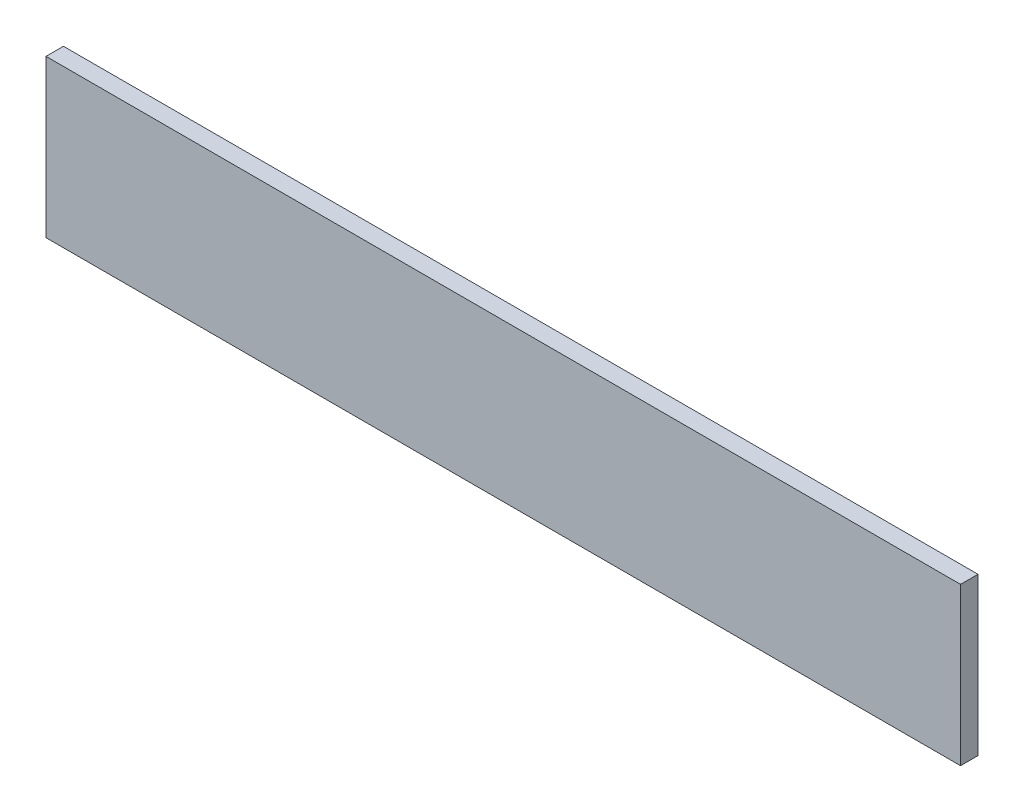
ISO-10303-21;
HEADER;
FILE_DESCRIPTION(('STEP AP214'),'2;1');
FILE_NAME('part.step','',(''),(''),'','','');
FILE_SCHEMA(('AUTOMOTIVE_DESIGN { 1 0 10303 214 1 1 1 1 }'));
ENDSEC;
DATA;
#1=APPLICATION_CONTEXT('core data for automotive mechanical design processes');
#2=APPLICATION_PROTOCOL_DEFINITION('international standard','automotive_design',2000,#1);
#3=PRODUCT_CONTEXT('',#1,'mechanical');
#4=PRODUCT('Part','Part','',(#3));
#5=PRODUCT_RELATED_PRODUCT_CATEGORY('part','',(#4));
#6=PRODUCT_DEFINITION_FORMATION('','',#4);
#7=PRODUCT_DEFINITION_CONTEXT('part definition',#1,'design');
#8=PRODUCT_DEFINITION('design','',#6,#7);
#9=PRODUCT_DEFINITION_SHAPE('','',#8);
#10=(LENGTH_UNIT() NAMED_UNIT(*) SI_UNIT(.MILLI.,.METRE.));
#11=(NAMED_UNIT(*) PLANE_ANGLE_UNIT() SI_UNIT($,.RADIAN.));
#12=(NAMED_UNIT(*) SI_UNIT($,.STERADIAN.) SOLID_ANGLE_UNIT());
#13=UNCERTAINTY_MEASURE_WITH_UNIT(LENGTH_MEASURE(1.E-05),#10,'distance_accuracy_value','');
#14=(GEOMETRIC_REPRESENTATION_CONTEXT(3) GLOBAL_UNCERTAINTY_ASSIGNED_CONTEXT((#13)) GLOBAL_UNIT_ASSIGNED_CONTEXT((#10,
#11,#12)) REPRESENTATION_CONTEXT('',''));
#15=CARTESIAN_POINT('',(0.,0.,0.));
#16=DIRECTION('',(0.,0.,1.));
#17=DIRECTION('',(1.,0.,0.));
#18=AXIS2_PLACEMENT_3D('',#15,#16,#17);
#19=CARTESIAN_POINT('',(0.,45.,5.));
#20=DIRECTION('',(0.,1.,0.));
#21=DIRECTION('',(0.,0.,1.));
#22=AXIS2_PLACEMENT_3D('',#19,#20,#21);
#23=PLANE('',#22);
#24=DIRECTION('',(1.,0.,0.));
#25=VECTOR('',#24,1.);
#26=CARTESIAN_POINT('',(0.,45.,0.));
#27=LINE('',#26,#25);
#28=CARTESIAN_POINT('',(0.,45.,0.));
#29=VERTEX_POINT('',#28);
#30=CARTESIAN_POINT('',(262.,45.,0.));
#31=VERTEX_POINT('',#30);
#32=EDGE_CURVE('E97',#29,#31,#27,.T.);
#33=ORIENTED_EDGE('',*,*,#32,.F.);
#34=DIRECTION('',(0.,0.,-1.));
#35=VECTOR('',#34,1.);
#36=CARTESIAN_POINT('',(0.,45.,5.));
#37=LINE('',#36,#35);
#38=CARTESIAN_POINT('',(0.,45.,5.));
#39=VERTEX_POINT('',#38);
#40=EDGE_CURVE('E11',#39,#29,#37,.T.);
#41=ORIENTED_EDGE('',*,*,#40,.F.);
#42=DIRECTION('',(1.,0.,0.));
#43=VECTOR('',#42,1.);
#44=CARTESIAN_POINT('',(0.,45.,5.));
#45=LINE('',#44,#43);
#46=CARTESIAN_POINT('',(262.,45.,5.));
#47=VERTEX_POINT('',#46);
#48=EDGE_CURVE('E91',#39,#47,#45,.T.);
#49=ORIENTED_EDGE('',*,*,#48,.T.);
#50=DIRECTION('',(0.,0.,-1.));
#51=VECTOR('',#50,1.);
#52=CARTESIAN_POINT('',(262.,45.,5.));
#53=LINE('',#52,#51);
#54=EDGE_CURVE('E36',#47,#31,#53,.T.);
#55=ORIENTED_EDGE('',*,*,#54,.T.);
#56=EDGE_LOOP('',(#33,#41,#49,#55));
#57=FACE_BOUND('',#56,.T.);
#58=ADVANCED_FACE('F33',(#57),#23,.T.);
#59=CARTESIAN_POINT('',(0.,0.,5.));
#60=DIRECTION('',(-1.,0.,0.));
#61=DIRECTION('',(0.,0.,1.));
#62=AXIS2_PLACEMENT_3D('',#59,#60,#61);
#63=PLANE('',#62);
#64=DIRECTION('',(0.,1.,0.));
#65=VECTOR('',#64,1.);
#66=CARTESIAN_POINT('',(0.,0.,0.));
#67=LINE('',#66,#65);
#68=CARTESIAN_POINT('',(0.,0.,0.));
#69=VERTEX_POINT('',#68);
#70=EDGE_CURVE('E93',#69,#29,#67,.T.);
#71=ORIENTED_EDGE('',*,*,#70,.F.);
#72=DIRECTION('',(0.,0.,-1.));
#73=VECTOR('',#72,1.);
#74=CARTESIAN_POINT('',(0.,0.,5.));
#75=LINE('',#74,#73);
#76=CARTESIAN_POINT('',(0.,0.,5.));
#77=VERTEX_POINT('',#76);
#78=EDGE_CURVE('E42',#77,#69,#75,.T.);
#79=ORIENTED_EDGE('',*,*,#78,.F.);
#80=DIRECTION('',(0.,1.,0.));
#81=VECTOR('',#80,1.);
#82=CARTESIAN_POINT('',(0.,0.,5.));
#83=LINE('',#82,#81);
#84=EDGE_CURVE('E81',#77,#39,#83,.T.);
#85=ORIENTED_EDGE('',*,*,#84,.T.);
#86=ORIENTED_EDGE('',*,*,#40,.T.);
#87=EDGE_LOOP('',(#71,#79,#85,#86));
#88=FACE_BOUND('',#87,.T.);
#89=ADVANCED_FACE('F107',(#88),#63,.T.);
#90=CARTESIAN_POINT('',(0.,0.,5.));
#91=DIRECTION('',(0.,1.,0.));
#92=DIRECTION('',(0.,0.,1.));
#93=AXIS2_PLACEMENT_3D('',#90,#91,#92);
#94=PLANE('',#93);
#95=DIRECTION('',(1.,0.,0.));
#96=VECTOR('',#95,1.);
#97=CARTESIAN_POINT('',(0.,0.,0.));
#98=LINE('',#97,#96);
#99=CARTESIAN_POINT('',(262.,0.,0.));
#100=VERTEX_POINT('',#99);
#101=EDGE_CURVE('E86',#69,#100,#98,.T.);
#102=ORIENTED_EDGE('',*,*,#101,.T.);
#103=DIRECTION('',(0.,0.,-1.));
#104=VECTOR('',#103,1.);
#105=CARTESIAN_POINT('',(262.,0.,5.));
#106=LINE('',#105,#104);
#107=CARTESIAN_POINT('',(262.,0.,5.));
#108=VERTEX_POINT('',#107);
#109=EDGE_CURVE('E84',#108,#100,#106,.T.);
#110=ORIENTED_EDGE('',*,*,#109,.F.);
#111=DIRECTION('',(1.,0.,0.));
#112=VECTOR('',#111,1.);
#113=CARTESIAN_POINT('',(0.,0.,5.));
#114=LINE('',#113,#112);
#115=EDGE_CURVE('E78',#77,#108,#114,.T.);
#116=ORIENTED_EDGE('',*,*,#115,.F.);
#117=ORIENTED_EDGE('',*,*,#78,.T.);
#118=EDGE_LOOP('',(#102,#110,#116,#117));
#119=FACE_BOUND('',#118,.T.);
#120=ADVANCED_FACE('F85',(#119),#94,.F.);
#121=CARTESIAN_POINT('',(262.,0.,5.));
#122=DIRECTION('',(-1.,0.,0.));
#123=DIRECTION('',(0.,0.,1.));
#124=AXIS2_PLACEMENT_3D('',#121,#122,#123);
#125=PLANE('',#124);
#126=DIRECTION('',(0.,1.,0.));
#127=VECTOR('',#126,1.);
#128=CARTESIAN_POINT('',(262.,0.,0.));
#129=LINE('',#128,#127);
#130=EDGE_CURVE('E100',#100,#31,#129,.T.);
#131=ORIENTED_EDGE('',*,*,#130,.T.);
#132=ORIENTED_EDGE('',*,*,#54,.F.);
#133=DIRECTION('',(0.,1.,0.));
#134=VECTOR('',#133,1.);
#135=CARTESIAN_POINT('',(262.,0.,5.));
#136=LINE('',#135,#134);
#137=EDGE_CURVE('E75',#108,#47,#136,.T.);
#138=ORIENTED_EDGE('',*,*,#137,.F.);
#139=ORIENTED_EDGE('',*,*,#109,.T.);
#140=EDGE_LOOP('',(#131,#132,#138,#139));
#141=FACE_BOUND('',#140,.T.);
#142=ADVANCED_FACE('F90',(#141),#125,.F.);
#143=CARTESIAN_POINT('',(0.,0.,5.));
#144=DIRECTION('',(0.,0.,1.));
#145=DIRECTION('',(1.,0.,0.));
#146=AXIS2_PLACEMENT_3D('',#143,#144,#145);
#147=PLANE('',#146);
#148=ORIENTED_EDGE('',*,*,#48,.F.);
#149=ORIENTED_EDGE('',*,*,#84,.F.);
#150=ORIENTED_EDGE('',*,*,#115,.T.);
#151=ORIENTED_EDGE('',*,*,#137,.T.);
#152=EDGE_LOOP('',(#148,#149,#150,#151));
#153=FACE_BOUND('',#152,.T.);
#154=ADVANCED_FACE('F80',(#153),#147,.T.);
#155=CARTESIAN_POINT('',(0.,0.,0.));
#156=DIRECTION('',(0.,0.,1.));
#157=DIRECTION('',(1.,0.,0.));
#158=AXIS2_PLACEMENT_3D('',#155,#156,#157);
#159=PLANE('',#158);
#160=ORIENTED_EDGE('',*,*,#32,.T.);
#161=ORIENTED_EDGE('',*,*,#130,.F.);
#162=ORIENTED_EDGE('',*,*,#101,.F.);
#163=ORIENTED_EDGE('',*,*,#70,.T.);
#164=EDGE_LOOP('',(#160,#161,#162,#163));
#165=FACE_BOUND('',#164,.T.);
#166=ADVANCED_FACE('F106',(#165),#159,.F.);
#167=CLOSED_SHELL('',(#58,#89,#120,#142,#154,#166));
#168=MANIFOLD_SOLID_BREP('B2',#167);
#169=ADVANCED_BREP_SHAPE_REPRESENTATION('',(#18,#168),#14);
#170=SHAPE_DEFINITION_REPRESENTATION(#9,#169);
ENDSEC;
END-ISO-10303-21;
